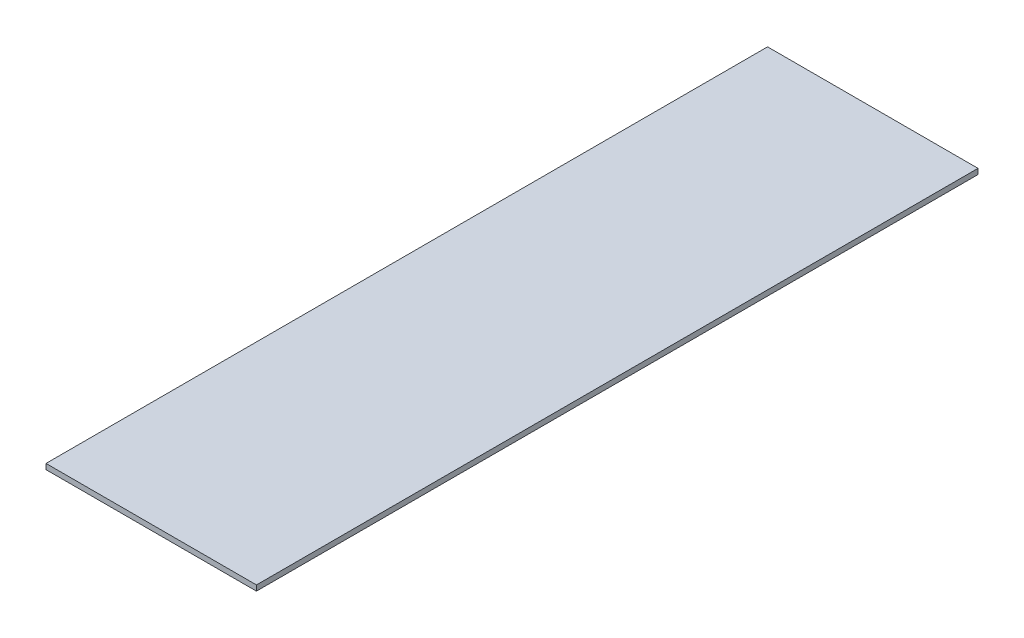
ISO-10303-21;
HEADER;
FILE_DESCRIPTION(('STEP AP214'),'2;1');
FILE_NAME('part.step','',(''),(''),'','','');
FILE_SCHEMA(('AUTOMOTIVE_DESIGN { 1 0 10303 214 1 1 1 1 }'));
ENDSEC;
DATA;
#1=APPLICATION_CONTEXT('core data for automotive mechanical design processes');
#2=APPLICATION_PROTOCOL_DEFINITION('international standard','automotive_design',2000,#1);
#3=PRODUCT_CONTEXT('',#1,'mechanical');
#4=PRODUCT('Part','Part','',(#3));
#5=PRODUCT_RELATED_PRODUCT_CATEGORY('part','',(#4));
#6=PRODUCT_DEFINITION_FORMATION('','',#4);
#7=PRODUCT_DEFINITION_CONTEXT('part definition',#1,'design');
#8=PRODUCT_DEFINITION('design','',#6,#7);
#9=PRODUCT_DEFINITION_SHAPE('','',#8);
#10=(LENGTH_UNIT() NAMED_UNIT(*) SI_UNIT(.MILLI.,.METRE.));
#11=(NAMED_UNIT(*) PLANE_ANGLE_UNIT() SI_UNIT($,.RADIAN.));
#12=(NAMED_UNIT(*) SI_UNIT($,.STERADIAN.) SOLID_ANGLE_UNIT());
#13=UNCERTAINTY_MEASURE_WITH_UNIT(LENGTH_MEASURE(1.E-05),#10,'distance_accuracy_value','');
#14=(GEOMETRIC_REPRESENTATION_CONTEXT(3) GLOBAL_UNCERTAINTY_ASSIGNED_CONTEXT((#13)) GLOBAL_UNIT_ASSIGNED_CONTEXT((#10,
#11,#12)) REPRESENTATION_CONTEXT('',''));
#15=CARTESIAN_POINT('',(0.,0.,0.));
#16=DIRECTION('',(0.,0.,1.));
#17=DIRECTION('',(1.,0.,0.));
#18=AXIS2_PLACEMENT_3D('',#15,#16,#17);
#19=CARTESIAN_POINT('',(0.,18.,0.));
#20=DIRECTION('',(1.,0.,0.));
#21=DIRECTION('',(0.,0.,-1.));
#22=AXIS2_PLACEMENT_3D('',#19,#20,#21);
#23=PLANE('',#22);
#24=DIRECTION('',(0.,0.,1.));
#25=VECTOR('',#24,1.);
#26=CARTESIAN_POINT('',(0.,0.,0.));
#27=LINE('',#26,#25);
#28=CARTESIAN_POINT('',(0.,0.,-2400.));
#29=VERTEX_POINT('',#28);
#30=CARTESIAN_POINT('',(0.,0.,0.));
#31=VERTEX_POINT('',#30);
#32=EDGE_CURVE('E96',#29,#31,#27,.T.);
#33=ORIENTED_EDGE('',*,*,#32,.T.);
#34=DIRECTION('',(0.,-1.,0.));
#35=VECTOR('',#34,1.);
#36=CARTESIAN_POINT('',(0.,18.,0.));
#37=LINE('',#36,#35);
#38=CARTESIAN_POINT('',(0.,18.,0.));
#39=VERTEX_POINT('',#38);
#40=EDGE_CURVE('E11',#39,#31,#37,.T.);
#41=ORIENTED_EDGE('',*,*,#40,.F.);
#42=DIRECTION('',(0.,0.,1.));
#43=VECTOR('',#42,1.);
#44=CARTESIAN_POINT('',(0.,18.,0.));
#45=LINE('',#44,#43);
#46=CARTESIAN_POINT('',(0.,18.,-2400.));
#47=VERTEX_POINT('',#46);
#48=EDGE_CURVE('E84',#47,#39,#45,.T.);
#49=ORIENTED_EDGE('',*,*,#48,.F.);
#50=DIRECTION('',(0.,-1.,0.));
#51=VECTOR('',#50,1.);
#52=CARTESIAN_POINT('',(0.,18.,-2400.));
#53=LINE('',#52,#51);
#54=EDGE_CURVE('E92',#47,#29,#53,.T.);
#55=ORIENTED_EDGE('',*,*,#54,.T.);
#56=EDGE_LOOP('',(#33,#41,#49,#55));
#57=FACE_BOUND('',#56,.T.);
#58=ADVANCED_FACE('F33',(#57),#23,.F.);
#59=CARTESIAN_POINT('',(0.,18.,0.));
#60=DIRECTION('',(0.,0.,-1.));
#61=DIRECTION('',(-1.,0.,0.));
#62=AXIS2_PLACEMENT_3D('',#59,#60,#61);
#63=PLANE('',#62);
#64=DIRECTION('',(1.,0.,0.));
#65=VECTOR('',#64,1.);
#66=CARTESIAN_POINT('',(0.,0.,0.));
#67=LINE('',#66,#65);
#68=CARTESIAN_POINT('',(700.,0.,0.));
#69=VERTEX_POINT('',#68);
#70=EDGE_CURVE('E88',#31,#69,#67,.T.);
#71=ORIENTED_EDGE('',*,*,#70,.T.);
#72=DIRECTION('',(0.,-1.,0.));
#73=VECTOR('',#72,1.);
#74=CARTESIAN_POINT('',(700.,18.,0.));
#75=LINE('',#74,#73);
#76=CARTESIAN_POINT('',(700.,18.,0.));
#77=VERTEX_POINT('',#76);
#78=EDGE_CURVE('E41',#77,#69,#75,.T.);
#79=ORIENTED_EDGE('',*,*,#78,.F.);
#80=DIRECTION('',(1.,0.,0.));
#81=VECTOR('',#80,1.);
#82=CARTESIAN_POINT('',(0.,18.,0.));
#83=LINE('',#82,#81);
#84=EDGE_CURVE('E79',#39,#77,#83,.T.);
#85=ORIENTED_EDGE('',*,*,#84,.F.);
#86=ORIENTED_EDGE('',*,*,#40,.T.);
#87=EDGE_LOOP('',(#71,#79,#85,#86));
#88=FACE_BOUND('',#87,.T.);
#89=ADVANCED_FACE('F87',(#88),#63,.F.);
#90=CARTESIAN_POINT('',(700.,18.,0.));
#91=DIRECTION('',(-1.,0.,0.));
#92=DIRECTION('',(0.,0.,1.));
#93=AXIS2_PLACEMENT_3D('',#90,#91,#92);
#94=PLANE('',#93);
#95=DIRECTION('',(0.,0.,-1.));
#96=VECTOR('',#95,1.);
#97=CARTESIAN_POINT('',(700.,0.,0.));
#98=LINE('',#97,#96);
#99=CARTESIAN_POINT('',(700.,0.,-2400.));
#100=VERTEX_POINT('',#99);
#101=EDGE_CURVE('E66',#69,#100,#98,.T.);
#102=ORIENTED_EDGE('',*,*,#101,.T.);
#103=DIRECTION('',(0.,-1.,0.));
#104=VECTOR('',#103,1.);
#105=CARTESIAN_POINT('',(700.,18.,-2400.));
#106=LINE('',#105,#104);
#107=CARTESIAN_POINT('',(700.,18.,-2400.));
#108=VERTEX_POINT('',#107);
#109=EDGE_CURVE('E89',#108,#100,#106,.T.);
#110=ORIENTED_EDGE('',*,*,#109,.F.);
#111=DIRECTION('',(0.,0.,-1.));
#112=VECTOR('',#111,1.);
#113=CARTESIAN_POINT('',(700.,18.,0.));
#114=LINE('',#113,#112);
#115=EDGE_CURVE('E82',#77,#108,#114,.T.);
#116=ORIENTED_EDGE('',*,*,#115,.F.);
#117=ORIENTED_EDGE('',*,*,#78,.T.);
#118=EDGE_LOOP('',(#102,#110,#116,#117));
#119=FACE_BOUND('',#118,.T.);
#120=ADVANCED_FACE('F90',(#119),#94,.F.);
#121=CARTESIAN_POINT('',(0.,18.,-2400.));
#122=DIRECTION('',(0.,0.,1.));
#123=DIRECTION('',(1.,0.,0.));
#124=AXIS2_PLACEMENT_3D('',#121,#122,#123);
#125=PLANE('',#124);
#126=DIRECTION('',(-1.,0.,0.));
#127=VECTOR('',#126,1.);
#128=CARTESIAN_POINT('',(0.,0.,-2400.));
#129=LINE('',#128,#127);
#130=EDGE_CURVE('E72',#100,#29,#129,.T.);
#131=ORIENTED_EDGE('',*,*,#130,.T.);
#132=ORIENTED_EDGE('',*,*,#54,.F.);
#133=DIRECTION('',(-1.,0.,0.));
#134=VECTOR('',#133,1.);
#135=CARTESIAN_POINT('',(0.,18.,-2400.));
#136=LINE('',#135,#134);
#137=EDGE_CURVE('E49',#108,#47,#136,.T.);
#138=ORIENTED_EDGE('',*,*,#137,.F.);
#139=ORIENTED_EDGE('',*,*,#109,.T.);
#140=EDGE_LOOP('',(#131,#132,#138,#139));
#141=FACE_BOUND('',#140,.T.);
#142=ADVANCED_FACE('F103',(#141),#125,.F.);
#143=CARTESIAN_POINT('',(0.,18.,0.));
#144=DIRECTION('',(0.,-1.,0.));
#145=DIRECTION('',(0.,0.,-1.));
#146=AXIS2_PLACEMENT_3D('',#143,#144,#145);
#147=PLANE('',#146);
#148=ORIENTED_EDGE('',*,*,#48,.T.);
#149=ORIENTED_EDGE('',*,*,#84,.T.);
#150=ORIENTED_EDGE('',*,*,#115,.T.);
#151=ORIENTED_EDGE('',*,*,#137,.T.);
#152=EDGE_LOOP('',(#148,#149,#150,#151));
#153=FACE_BOUND('',#152,.T.);
#154=ADVANCED_FACE('F80',(#153),#147,.F.);
#155=CARTESIAN_POINT('',(0.,0.,0.));
#156=DIRECTION('',(0.,-1.,0.));
#157=DIRECTION('',(0.,0.,-1.));
#158=AXIS2_PLACEMENT_3D('',#155,#156,#157);
#159=PLANE('',#158);
#160=ORIENTED_EDGE('',*,*,#32,.F.);
#161=ORIENTED_EDGE('',*,*,#130,.F.);
#162=ORIENTED_EDGE('',*,*,#101,.F.);
#163=ORIENTED_EDGE('',*,*,#70,.F.);
#164=EDGE_LOOP('',(#160,#161,#162,#163));
#165=FACE_BOUND('',#164,.T.);
#166=ADVANCED_FACE('F106',(#165),#159,.T.);
#167=CLOSED_SHELL('',(#58,#89,#120,#142,#154,#166));
#168=MANIFOLD_SOLID_BREP('B2',#167);
#169=ADVANCED_BREP_SHAPE_REPRESENTATION('',(#18,#168),#14);
#170=SHAPE_DEFINITION_REPRESENTATION(#9,#169);
ENDSEC;
END-ISO-10303-21;
